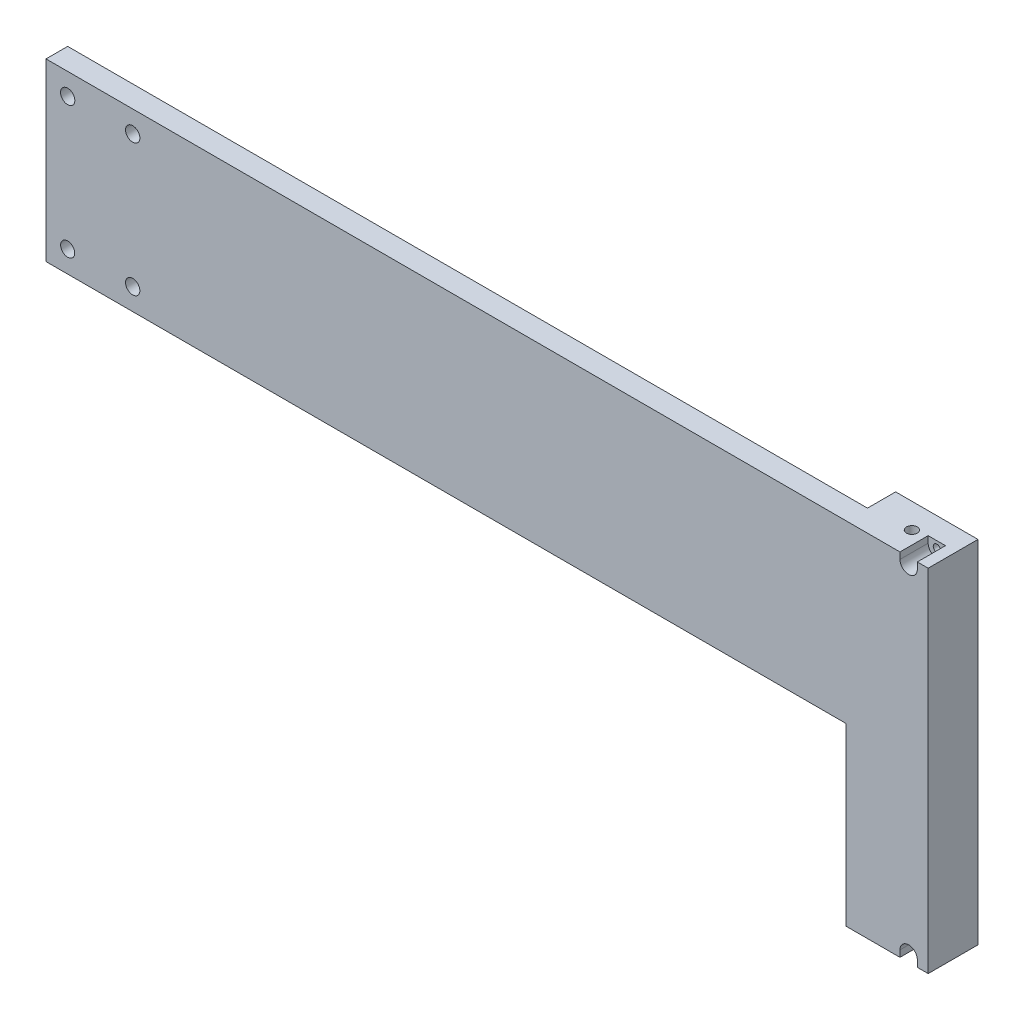
ISO-10303-21;
HEADER;
FILE_DESCRIPTION(('STEP AP214'),'2;1');
FILE_NAME('part.step','',(''),(''),'','','');
FILE_SCHEMA(('AUTOMOTIVE_DESIGN { 1 0 10303 214 1 1 1 1 }'));
ENDSEC;
DATA;
#1=APPLICATION_CONTEXT('core data for automotive mechanical design processes');
#2=APPLICATION_PROTOCOL_DEFINITION('international standard','automotive_design',2000,#1);
#3=PRODUCT_CONTEXT('',#1,'mechanical');
#4=PRODUCT('Part','Part','',(#3));
#5=PRODUCT_RELATED_PRODUCT_CATEGORY('part','',(#4));
#6=PRODUCT_DEFINITION_FORMATION('','',#4);
#7=PRODUCT_DEFINITION_CONTEXT('part definition',#1,'design');
#8=PRODUCT_DEFINITION('design','',#6,#7);
#9=PRODUCT_DEFINITION_SHAPE('','',#8);
#10=(LENGTH_UNIT() NAMED_UNIT(*) SI_UNIT(.MILLI.,.METRE.));
#11=(NAMED_UNIT(*) PLANE_ANGLE_UNIT() SI_UNIT($,.RADIAN.));
#12=(NAMED_UNIT(*) SI_UNIT($,.STERADIAN.) SOLID_ANGLE_UNIT());
#13=UNCERTAINTY_MEASURE_WITH_UNIT(LENGTH_MEASURE(1.E-05),#10,'distance_accuracy_value','');
#14=(GEOMETRIC_REPRESENTATION_CONTEXT(3) GLOBAL_UNCERTAINTY_ASSIGNED_CONTEXT((#13)) GLOBAL_UNIT_ASSIGNED_CONTEXT((#10,
#11,#12)) REPRESENTATION_CONTEXT('',''));
#15=CARTESIAN_POINT('',(0.,0.,0.));
#16=DIRECTION('',(0.,0.,1.));
#17=DIRECTION('',(1.,0.,0.));
#18=AXIS2_PLACEMENT_3D('',#15,#16,#17);
#19=CARTESIAN_POINT('',(398.,78.,-13.));
#20=DIRECTION('',(0.,0.,1.));
#21=DIRECTION('',(1.,0.,0.));
#22=AXIS2_PLACEMENT_3D('',#19,#20,#21);
#23=CYLINDRICAL_SURFACE('',#22,1.64999999999999);
#24=CARTESIAN_POINT('',(398.,78.,-13.));
#25=DIRECTION('',(0.,0.,1.));
#26=DIRECTION('',(1.,0.,0.));
#27=AXIS2_PLACEMENT_3D('',#24,#25,#26);
#28=CIRCLE('',#27,1.64999999999999);
#29=CARTESIAN_POINT('',(399.65,78.,-13.));
#30=VERTEX_POINT('',#29);
#31=EDGE_CURVE('E218',#30,#30,#28,.T.);
#32=ORIENTED_EDGE('',*,*,#31,.F.);
#33=EDGE_LOOP('',(#32));
#34=FACE_BOUND('',#33,.T.);
#35=CARTESIAN_POINT('',(398.,78.,-3.));
#36=DIRECTION('',(0.,0.,1.));
#37=DIRECTION('',(1.,0.,0.));
#38=AXIS2_PLACEMENT_3D('',#35,#36,#37);
#39=CIRCLE('',#38,1.64999999999999);
#40=CARTESIAN_POINT('',(399.65,78.,-3.));
#41=VERTEX_POINT('',#40);
#42=EDGE_CURVE('E221',#41,#41,#39,.F.);
#43=ORIENTED_EDGE('',*,*,#42,.F.);
#44=EDGE_LOOP('',(#43));
#45=FACE_BOUND('',#44,.T.);
#46=ADVANCED_FACE('F40',(#34,#45),#23,.F.);
#47=CARTESIAN_POINT('',(398.,-78.,-13.));
#48=DIRECTION('',(0.,0.,1.));
#49=DIRECTION('',(1.,0.,0.));
#50=AXIS2_PLACEMENT_3D('',#47,#48,#49);
#51=CYLINDRICAL_SURFACE('',#50,1.64999999999999);
#52=CARTESIAN_POINT('',(398.,-78.,-13.));
#53=DIRECTION('',(0.,0.,1.));
#54=DIRECTION('',(1.,0.,0.));
#55=AXIS2_PLACEMENT_3D('',#52,#53,#54);
#56=CIRCLE('',#55,1.64999999999999);
#57=CARTESIAN_POINT('',(399.65,-78.,-13.));
#58=VERTEX_POINT('',#57);
#59=EDGE_CURVE('E214',#58,#58,#56,.T.);
#60=ORIENTED_EDGE('',*,*,#59,.F.);
#61=EDGE_LOOP('',(#60));
#62=FACE_BOUND('',#61,.T.);
#63=CARTESIAN_POINT('',(398.,-78.,-3.));
#64=DIRECTION('',(0.,0.,1.));
#65=DIRECTION('',(1.,0.,0.));
#66=AXIS2_PLACEMENT_3D('',#63,#64,#65);
#67=CIRCLE('',#66,1.64999999999999);
#68=CARTESIAN_POINT('',(399.65,-78.,-3.));
#69=VERTEX_POINT('',#68);
#70=EDGE_CURVE('E186',#69,#69,#67,.F.);
#71=ORIENTED_EDGE('',*,*,#70,.F.);
#72=EDGE_LOOP('',(#71));
#73=FACE_BOUND('',#72,.T.);
#74=ADVANCED_FACE('F375',(#62,#73),#51,.F.);
#75=CARTESIAN_POINT('',(0.,0.,10.));
#76=DIRECTION('',(1.,0.,0.));
#77=DIRECTION('',(0.,0.,-1.));
#78=AXIS2_PLACEMENT_3D('',#75,#76,#77);
#79=PLANE('',#78);
#80=DIRECTION('',(0.,-1.,0.));
#81=VECTOR('',#80,1.);
#82=CARTESIAN_POINT('',(0.,0.,0.));
#83=LINE('',#82,#81);
#84=CARTESIAN_POINT('',(0.,81.,0.));
#85=VERTEX_POINT('',#84);
#86=CARTESIAN_POINT('',(0.,0.,0.));
#87=VERTEX_POINT('',#86);
#88=EDGE_CURVE('E257',#85,#87,#83,.T.);
#89=ORIENTED_EDGE('',*,*,#88,.T.);
#90=DIRECTION('',(0.,0.,-1.));
#91=VECTOR('',#90,1.);
#92=CARTESIAN_POINT('',(0.,0.,10.));
#93=LINE('',#92,#91);
#94=CARTESIAN_POINT('',(0.,0.,10.));
#95=VERTEX_POINT('',#94);
#96=EDGE_CURVE('E11',#95,#87,#93,.T.);
#97=ORIENTED_EDGE('',*,*,#96,.F.);
#98=DIRECTION('',(0.,-1.,0.));
#99=VECTOR('',#98,1.);
#100=CARTESIAN_POINT('',(0.,0.,10.));
#101=LINE('',#100,#99);
#102=CARTESIAN_POINT('',(0.,81.,10.));
#103=VERTEX_POINT('',#102);
#104=EDGE_CURVE('E258',#103,#95,#101,.T.);
#105=ORIENTED_EDGE('',*,*,#104,.F.);
#106=DIRECTION('',(0.,0.,-1.));
#107=VECTOR('',#106,1.);
#108=CARTESIAN_POINT('',(0.,81.,10.));
#109=LINE('',#108,#107);
#110=EDGE_CURVE('E268',#103,#85,#109,.T.);
#111=ORIENTED_EDGE('',*,*,#110,.T.);
#112=EDGE_LOOP('',(#89,#97,#105,#111));
#113=FACE_BOUND('',#112,.T.);
#114=ADVANCED_FACE('F42',(#113),#79,.F.);
#115=CARTESIAN_POINT('',(0.,0.,10.));
#116=DIRECTION('',(0.,1.,0.));
#117=DIRECTION('',(0.,0.,1.));
#118=AXIS2_PLACEMENT_3D('',#115,#116,#117);
#119=PLANE('',#118);
#120=DIRECTION('',(1.,0.,0.));
#121=VECTOR('',#120,1.);
#122=CARTESIAN_POINT('',(0.,0.,0.));
#123=LINE('',#122,#121);
#124=CARTESIAN_POINT('',(369.,0.,0.));
#125=VERTEX_POINT('',#124);
#126=EDGE_CURVE('E271',#87,#125,#123,.T.);
#127=ORIENTED_EDGE('',*,*,#126,.T.);
#128=DIRECTION('',(0.,0.,-1.));
#129=VECTOR('',#128,1.);
#130=CARTESIAN_POINT('',(369.,0.,10.));
#131=LINE('',#130,#129);
#132=CARTESIAN_POINT('',(369.,0.,10.));
#133=VERTEX_POINT('',#132);
#134=EDGE_CURVE('E49',#133,#125,#131,.T.);
#135=ORIENTED_EDGE('',*,*,#134,.F.);
#136=DIRECTION('',(1.,0.,0.));
#137=VECTOR('',#136,1.);
#138=CARTESIAN_POINT('',(0.,0.,10.));
#139=LINE('',#138,#137);
#140=EDGE_CURVE('E261',#95,#133,#139,.T.);
#141=ORIENTED_EDGE('',*,*,#140,.F.);
#142=ORIENTED_EDGE('',*,*,#96,.T.);
#143=EDGE_LOOP('',(#127,#135,#141,#142));
#144=FACE_BOUND('',#143,.T.);
#145=ADVANCED_FACE('F331',(#144),#119,.F.);
#146=CARTESIAN_POINT('',(0.,81.,10.));
#147=DIRECTION('',(0.,-1.,0.));
#148=DIRECTION('',(0.,0.,-1.));
#149=AXIS2_PLACEMENT_3D('',#146,#147,#148);
#150=PLANE('',#149);
#151=DIRECTION('',(-1.,0.,0.));
#152=VECTOR('',#151,1.);
#153=CARTESIAN_POINT('',(0.,81.,10.));
#154=LINE('',#153,#152);
#155=CARTESIAN_POINT('',(394.,81.,10.));
#156=VERTEX_POINT('',#155);
#157=EDGE_CURVE('E264',#156,#103,#154,.T.);
#158=ORIENTED_EDGE('',*,*,#157,.F.);
#159=DIRECTION('',(0.,0.,1.));
#160=VECTOR('',#159,1.);
#161=CARTESIAN_POINT('',(394.,81.,-3.));
#162=LINE('',#161,#160);
#163=CARTESIAN_POINT('',(394.,81.,-3.));
#164=VERTEX_POINT('',#163);
#165=EDGE_CURVE('E187',#164,#156,#162,.T.);
#166=ORIENTED_EDGE('',*,*,#165,.F.);
#167=DIRECTION('',(-1.,0.,0.));
#168=VECTOR('',#167,1.);
#169=CARTESIAN_POINT('',(394.,81.,-3.));
#170=LINE('',#169,#168);
#171=CARTESIAN_POINT('',(402.,81.,-3.));
#172=VERTEX_POINT('',#171);
#173=EDGE_CURVE('E165',#172,#164,#170,.T.);
#174=ORIENTED_EDGE('',*,*,#173,.F.);
#175=DIRECTION('',(0.,0.,1.));
#176=VECTOR('',#175,1.);
#177=CARTESIAN_POINT('',(402.,81.,-3.));
#178=LINE('',#177,#176);
#179=CARTESIAN_POINT('',(402.,81.,10.));
#180=VERTEX_POINT('',#179);
#181=EDGE_CURVE('E156',#172,#180,#178,.T.);
#182=ORIENTED_EDGE('',*,*,#181,.T.);
#183=CARTESIAN_POINT('',(407.,81.,10.));
#184=VERTEX_POINT('',#183);
#185=EDGE_CURVE('E265',#184,#180,#154,.T.);
#186=ORIENTED_EDGE('',*,*,#185,.F.);
#187=DIRECTION('',(0.,0.,1.));
#188=VECTOR('',#187,1.);
#189=CARTESIAN_POINT('',(407.,81.,10.));
#190=LINE('',#189,#188);
#191=CARTESIAN_POINT('',(407.,81.,-13.));
#192=VERTEX_POINT('',#191);
#193=EDGE_CURVE('E236',#192,#184,#190,.T.);
#194=ORIENTED_EDGE('',*,*,#193,.F.);
#195=DIRECTION('',(-1.,0.,0.));
#196=VECTOR('',#195,1.);
#197=CARTESIAN_POINT('',(407.,81.,-13.));
#198=LINE('',#197,#196);
#199=CARTESIAN_POINT('',(369.,81.,-13.));
#200=VERTEX_POINT('',#199);
#201=EDGE_CURVE('E239',#192,#200,#198,.T.);
#202=ORIENTED_EDGE('',*,*,#201,.T.);
#203=DIRECTION('',(0.,0.,1.));
#204=VECTOR('',#203,1.);
#205=CARTESIAN_POINT('',(369.,81.,10.));
#206=LINE('',#205,#204);
#207=CARTESIAN_POINT('',(369.,81.,0.));
#208=VERTEX_POINT('',#207);
#209=EDGE_CURVE('E232',#200,#208,#206,.T.);
#210=ORIENTED_EDGE('',*,*,#209,.T.);
#211=DIRECTION('',(-1.,0.,0.));
#212=VECTOR('',#211,1.);
#213=CARTESIAN_POINT('',(0.,81.,0.));
#214=LINE('',#213,#212);
#215=EDGE_CURVE('E262',#208,#85,#214,.T.);
#216=ORIENTED_EDGE('',*,*,#215,.T.);
#217=ORIENTED_EDGE('',*,*,#110,.F.);
#218=EDGE_LOOP('',(#158,#166,#174,#182,#186,#194,#202,#210,#216,#217));
#219=FACE_BOUND('',#218,.T.);
#220=CARTESIAN_POINT('',(388.,81.,-1.5));
#221=DIRECTION('',(0.,1.,0.));
#222=DIRECTION('',(0.,0.,1.));
#223=AXIS2_PLACEMENT_3D('',#220,#221,#222);
#224=CIRCLE('',#223,2.50000000000002);
#225=CARTESIAN_POINT('',(388.,81.,1.00000000000002));
#226=VERTEX_POINT('',#225);
#227=EDGE_CURVE('E217',#226,#226,#224,.T.);
#228=ORIENTED_EDGE('',*,*,#227,.F.);
#229=EDGE_LOOP('',(#228));
#230=FACE_BOUND('',#229,.T.);
#231=ADVANCED_FACE('F319',(#219,#230),#150,.F.);
#232=CARTESIAN_POINT('',(0.,0.,10.));
#233=DIRECTION('',(0.,0.,-1.));
#234=DIRECTION('',(-1.,0.,0.));
#235=AXIS2_PLACEMENT_3D('',#232,#233,#234);
#236=PLANE('',#235);
#237=CARTESIAN_POINT('',(10.,10.,10.));
#238=DIRECTION('',(0.,0.,1.));
#239=DIRECTION('',(1.,0.,0.));
#240=AXIS2_PLACEMENT_3D('',#237,#238,#239);
#241=CIRCLE('',#240,3.25);
#242=CARTESIAN_POINT('',(13.25,10.,10.));
#243=VERTEX_POINT('',#242);
#244=EDGE_CURVE('E545',#243,#243,#241,.T.);
#245=ORIENTED_EDGE('',*,*,#244,.F.);
#246=EDGE_LOOP('',(#245));
#247=FACE_BOUND('',#246,.T.);
#248=CARTESIAN_POINT('',(40.,10.,10.));
#249=DIRECTION('',(0.,0.,1.));
#250=DIRECTION('',(1.,0.,0.));
#251=AXIS2_PLACEMENT_3D('',#248,#249,#250);
#252=CIRCLE('',#251,3.3);
#253=CARTESIAN_POINT('',(43.3,10.,10.));
#254=VERTEX_POINT('',#253);
#255=EDGE_CURVE('E542',#254,#254,#252,.T.);
#256=ORIENTED_EDGE('',*,*,#255,.F.);
#257=EDGE_LOOP('',(#256));
#258=FACE_BOUND('',#257,.T.);
#259=CARTESIAN_POINT('',(40.,71.,10.));
#260=DIRECTION('',(0.,0.,1.));
#261=DIRECTION('',(1.,0.,0.));
#262=AXIS2_PLACEMENT_3D('',#259,#260,#261);
#263=CIRCLE('',#262,3.3);
#264=CARTESIAN_POINT('',(43.3,71.,10.));
#265=VERTEX_POINT('',#264);
#266=EDGE_CURVE('E544',#265,#265,#263,.T.);
#267=ORIENTED_EDGE('',*,*,#266,.F.);
#268=EDGE_LOOP('',(#267));
#269=FACE_BOUND('',#268,.T.);
#270=CARTESIAN_POINT('',(10.,71.,10.));
#271=DIRECTION('',(0.,0.,1.));
#272=DIRECTION('',(1.,0.,0.));
#273=AXIS2_PLACEMENT_3D('',#270,#271,#272);
#274=CIRCLE('',#273,3.3);
#275=CARTESIAN_POINT('',(13.3,71.,10.));
#276=VERTEX_POINT('',#275);
#277=EDGE_CURVE('E176',#276,#276,#274,.T.);
#278=ORIENTED_EDGE('',*,*,#277,.F.);
#279=EDGE_LOOP('',(#278));
#280=FACE_BOUND('',#279,.T.);
#281=CARTESIAN_POINT('',(398.,78.,10.));
#282=DIRECTION('',(0.,0.,1.));
#283=DIRECTION('',(1.,0.,0.));
#284=AXIS2_PLACEMENT_3D('',#281,#282,#283);
#285=CIRCLE('',#284,4.);
#286=CARTESIAN_POINT('',(394.,78.,10.));
#287=VERTEX_POINT('',#286);
#288=CARTESIAN_POINT('',(402.,78.,10.));
#289=VERTEX_POINT('',#288);
#290=EDGE_CURVE('E57',#287,#289,#285,.T.);
#291=ORIENTED_EDGE('',*,*,#290,.F.);
#292=DIRECTION('',(0.,-1.,0.));
#293=VECTOR('',#292,1.);
#294=CARTESIAN_POINT('',(394.,78.,10.));
#295=LINE('',#294,#293);
#296=EDGE_CURVE('E170',#156,#287,#295,.T.);
#297=ORIENTED_EDGE('',*,*,#296,.F.);
#298=ORIENTED_EDGE('',*,*,#157,.T.);
#299=ORIENTED_EDGE('',*,*,#104,.T.);
#300=ORIENTED_EDGE('',*,*,#140,.T.);
#301=DIRECTION('',(0.,-1.,0.));
#302=VECTOR('',#301,1.);
#303=CARTESIAN_POINT('',(369.,81.,10.));
#304=LINE('',#303,#302);
#305=CARTESIAN_POINT('',(369.,-81.,9.99999999999998));
#306=VERTEX_POINT('',#305);
#307=EDGE_CURVE('E225',#133,#306,#304,.T.);
#308=ORIENTED_EDGE('',*,*,#307,.T.);
#309=DIRECTION('',(-1.,0.,0.));
#310=VECTOR('',#309,1.);
#311=CARTESIAN_POINT('',(407.,-81.,9.99999999999998));
#312=LINE('',#311,#310);
#313=CARTESIAN_POINT('',(394.,-81.,10.));
#314=VERTEX_POINT('',#313);
#315=EDGE_CURVE('E253',#314,#306,#312,.T.);
#316=ORIENTED_EDGE('',*,*,#315,.F.);
#317=DIRECTION('',(0.,-1.,0.));
#318=VECTOR('',#317,1.);
#319=CARTESIAN_POINT('',(394.,-78.,10.));
#320=LINE('',#319,#318);
#321=CARTESIAN_POINT('',(394.,-78.,10.));
#322=VERTEX_POINT('',#321);
#323=EDGE_CURVE('E203',#322,#314,#320,.T.);
#324=ORIENTED_EDGE('',*,*,#323,.F.);
#325=CARTESIAN_POINT('',(398.,-78.,10.));
#326=DIRECTION('',(0.,0.,1.));
#327=DIRECTION('',(1.,0.,0.));
#328=AXIS2_PLACEMENT_3D('',#325,#326,#327);
#329=CIRCLE('',#328,4.);
#330=CARTESIAN_POINT('',(402.,-78.,10.));
#331=VERTEX_POINT('',#330);
#332=EDGE_CURVE('E200',#331,#322,#329,.T.);
#333=ORIENTED_EDGE('',*,*,#332,.F.);
#334=DIRECTION('',(0.,1.,0.));
#335=VECTOR('',#334,1.);
#336=CARTESIAN_POINT('',(402.,-78.,10.));
#337=LINE('',#336,#335);
#338=CARTESIAN_POINT('',(402.,-81.,10.));
#339=VERTEX_POINT('',#338);
#340=EDGE_CURVE('E192',#339,#331,#337,.T.);
#341=ORIENTED_EDGE('',*,*,#340,.F.);
#342=CARTESIAN_POINT('',(407.,-81.,9.99999999999998));
#343=VERTEX_POINT('',#342);
#344=EDGE_CURVE('E254',#343,#339,#312,.T.);
#345=ORIENTED_EDGE('',*,*,#344,.F.);
#346=DIRECTION('',(0.,-1.,0.));
#347=VECTOR('',#346,1.);
#348=CARTESIAN_POINT('',(407.,81.,10.));
#349=LINE('',#348,#347);
#350=EDGE_CURVE('E228',#184,#343,#349,.T.);
#351=ORIENTED_EDGE('',*,*,#350,.F.);
#352=ORIENTED_EDGE('',*,*,#185,.T.);
#353=DIRECTION('',(0.,1.,0.));
#354=VECTOR('',#353,1.);
#355=CARTESIAN_POINT('',(402.,78.,10.));
#356=LINE('',#355,#354);
#357=EDGE_CURVE('E173',#289,#180,#356,.T.);
#358=ORIENTED_EDGE('',*,*,#357,.F.);
#359=EDGE_LOOP('',(#291,#297,#298,#299,#300,#308,#316,#324,#333,#341,#345,#351,#352,#358));
#360=FACE_BOUND('',#359,.T.);
#361=ADVANCED_FACE('F305',(#247,#258,#269,#280,#360),#236,.F.);
#362=CARTESIAN_POINT('',(0.,0.,0.));
#363=DIRECTION('',(0.,0.,-1.));
#364=DIRECTION('',(-1.,0.,0.));
#365=AXIS2_PLACEMENT_3D('',#362,#363,#364);
#366=PLANE('',#365);
#367=CARTESIAN_POINT('',(10.,10.,0.));
#368=DIRECTION('',(0.,0.,-1.));
#369=DIRECTION('',(-1.,0.,0.));
#370=AXIS2_PLACEMENT_3D('',#367,#368,#369);
#371=CIRCLE('',#370,3.25);
#372=CARTESIAN_POINT('',(6.75000000000001,10.,0.));
#373=VERTEX_POINT('',#372);
#374=EDGE_CURVE('E44',#373,#373,#371,.T.);
#375=ORIENTED_EDGE('',*,*,#374,.F.);
#376=EDGE_LOOP('',(#375));
#377=FACE_BOUND('',#376,.T.);
#378=CARTESIAN_POINT('',(40.,10.,0.));
#379=DIRECTION('',(0.,0.,-1.));
#380=DIRECTION('',(-1.,0.,0.));
#381=AXIS2_PLACEMENT_3D('',#378,#379,#380);
#382=CIRCLE('',#381,3.3);
#383=CARTESIAN_POINT('',(36.7,10.,0.));
#384=VERTEX_POINT('',#383);
#385=EDGE_CURVE('E291',#384,#384,#382,.T.);
#386=ORIENTED_EDGE('',*,*,#385,.F.);
#387=EDGE_LOOP('',(#386));
#388=FACE_BOUND('',#387,.T.);
#389=CARTESIAN_POINT('',(40.,71.,0.));
#390=DIRECTION('',(0.,0.,-1.));
#391=DIRECTION('',(-1.,0.,0.));
#392=AXIS2_PLACEMENT_3D('',#389,#390,#391);
#393=CIRCLE('',#392,3.3);
#394=CARTESIAN_POINT('',(36.7,71.,0.));
#395=VERTEX_POINT('',#394);
#396=EDGE_CURVE('E289',#395,#395,#393,.T.);
#397=ORIENTED_EDGE('',*,*,#396,.F.);
#398=EDGE_LOOP('',(#397));
#399=FACE_BOUND('',#398,.T.);
#400=CARTESIAN_POINT('',(10.,71.,0.));
#401=DIRECTION('',(0.,0.,-1.));
#402=DIRECTION('',(-1.,0.,0.));
#403=AXIS2_PLACEMENT_3D('',#400,#401,#402);
#404=CIRCLE('',#403,3.3);
#405=CARTESIAN_POINT('',(6.70000000000001,71.,0.));
#406=VERTEX_POINT('',#405);
#407=EDGE_CURVE('E286',#406,#406,#404,.T.);
#408=ORIENTED_EDGE('',*,*,#407,.F.);
#409=EDGE_LOOP('',(#408));
#410=FACE_BOUND('',#409,.T.);
#411=ORIENTED_EDGE('',*,*,#88,.F.);
#412=ORIENTED_EDGE('',*,*,#215,.F.);
#413=DIRECTION('',(0.,1.,0.));
#414=VECTOR('',#413,1.);
#415=CARTESIAN_POINT('',(369.,0.,0.));
#416=LINE('',#415,#414);
#417=EDGE_CURVE('E274',#125,#208,#416,.T.);
#418=ORIENTED_EDGE('',*,*,#417,.F.);
#419=ORIENTED_EDGE('',*,*,#126,.F.);
#420=EDGE_LOOP('',(#411,#412,#418,#419));
#421=FACE_BOUND('',#420,.T.);
#422=ADVANCED_FACE('F301',(#377,#388,#399,#410,#421),#366,.T.);
#423=CARTESIAN_POINT('',(369.,0.,0.));
#424=DIRECTION('',(1.,0.,0.));
#425=DIRECTION('',(0.,0.,-1.));
#426=AXIS2_PLACEMENT_3D('',#423,#424,#425);
#427=PLANE('',#426);
#428=ORIENTED_EDGE('',*,*,#134,.T.);
#429=ORIENTED_EDGE('',*,*,#417,.T.);
#430=ORIENTED_EDGE('',*,*,#209,.F.);
#431=DIRECTION('',(0.,1.,0.));
#432=VECTOR('',#431,1.);
#433=CARTESIAN_POINT('',(369.,81.,-13.));
#434=LINE('',#433,#432);
#435=CARTESIAN_POINT('',(369.,-81.,-13.));
#436=VERTEX_POINT('',#435);
#437=EDGE_CURVE('E244',#436,#200,#434,.T.);
#438=ORIENTED_EDGE('',*,*,#437,.F.);
#439=DIRECTION('',(0.,0.,-1.));
#440=VECTOR('',#439,1.);
#441=CARTESIAN_POINT('',(369.,-81.,9.99999999999998));
#442=LINE('',#441,#440);
#443=EDGE_CURVE('E242',#306,#436,#442,.T.);
#444=ORIENTED_EDGE('',*,*,#443,.F.);
#445=ORIENTED_EDGE('',*,*,#307,.F.);
#446=EDGE_LOOP('',(#428,#429,#430,#438,#444,#445));
#447=FACE_BOUND('',#446,.T.);
#448=ADVANCED_FACE('F304',(#447),#427,.F.);
#449=CARTESIAN_POINT('',(407.,-81.,9.99999999999998));
#450=DIRECTION('',(0.,1.,0.));
#451=DIRECTION('',(0.,0.,1.));
#452=AXIS2_PLACEMENT_3D('',#449,#450,#451);
#453=PLANE('',#452);
#454=ORIENTED_EDGE('',*,*,#344,.T.);
#455=DIRECTION('',(0.,0.,1.));
#456=VECTOR('',#455,1.);
#457=CARTESIAN_POINT('',(402.,-81.,-3.));
#458=LINE('',#457,#456);
#459=CARTESIAN_POINT('',(402.,-81.,-3.));
#460=VERTEX_POINT('',#459);
#461=EDGE_CURVE('E208',#460,#339,#458,.T.);
#462=ORIENTED_EDGE('',*,*,#461,.F.);
#463=DIRECTION('',(1.,0.,0.));
#464=VECTOR('',#463,1.);
#465=CARTESIAN_POINT('',(394.,-81.,-3.));
#466=LINE('',#465,#464);
#467=CARTESIAN_POINT('',(394.,-81.,-3.));
#468=VERTEX_POINT('',#467);
#469=EDGE_CURVE('E194',#468,#460,#466,.T.);
#470=ORIENTED_EDGE('',*,*,#469,.F.);
#471=DIRECTION('',(0.,0.,1.));
#472=VECTOR('',#471,1.);
#473=CARTESIAN_POINT('',(394.,-81.,-3.));
#474=LINE('',#473,#472);
#475=EDGE_CURVE('E210',#468,#314,#474,.T.);
#476=ORIENTED_EDGE('',*,*,#475,.T.);
#477=ORIENTED_EDGE('',*,*,#315,.T.);
#478=ORIENTED_EDGE('',*,*,#443,.T.);
#479=DIRECTION('',(-1.,0.,0.));
#480=VECTOR('',#479,1.);
#481=CARTESIAN_POINT('',(407.,-81.,-13.));
#482=LINE('',#481,#480);
#483=CARTESIAN_POINT('',(407.,-81.,-13.));
#484=VERTEX_POINT('',#483);
#485=EDGE_CURVE('E250',#484,#436,#482,.T.);
#486=ORIENTED_EDGE('',*,*,#485,.F.);
#487=DIRECTION('',(0.,0.,-1.));
#488=VECTOR('',#487,1.);
#489=CARTESIAN_POINT('',(407.,-81.,9.99999999999998));
#490=LINE('',#489,#488);
#491=EDGE_CURVE('E231',#343,#484,#490,.T.);
#492=ORIENTED_EDGE('',*,*,#491,.F.);
#493=EDGE_LOOP('',(#454,#462,#470,#476,#477,#478,#486,#492));
#494=FACE_BOUND('',#493,.T.);
#495=CARTESIAN_POINT('',(388.,-81.,-1.5));
#496=DIRECTION('',(0.,1.,0.));
#497=DIRECTION('',(0.,0.,1.));
#498=AXIS2_PLACEMENT_3D('',#495,#496,#497);
#499=CIRCLE('',#498,2.50000000000002);
#500=CARTESIAN_POINT('',(388.,-81.,1.00000000000002));
#501=VERTEX_POINT('',#500);
#502=EDGE_CURVE('E222',#501,#501,#499,.T.);
#503=ORIENTED_EDGE('',*,*,#502,.T.);
#504=EDGE_LOOP('',(#503));
#505=FACE_BOUND('',#504,.T.);
#506=ADVANCED_FACE('F346',(#494,#505),#453,.F.);
#507=CARTESIAN_POINT('',(407.,81.,-13.));
#508=DIRECTION('',(0.,0.,1.));
#509=DIRECTION('',(0.,-1.,0.));
#510=AXIS2_PLACEMENT_3D('',#507,#508,#509);
#511=PLANE('',#510);
#512=ORIENTED_EDGE('',*,*,#59,.T.);
#513=EDGE_LOOP('',(#512));
#514=FACE_BOUND('',#513,.T.);
#515=ORIENTED_EDGE('',*,*,#31,.T.);
#516=EDGE_LOOP('',(#515));
#517=FACE_BOUND('',#516,.T.);
#518=ORIENTED_EDGE('',*,*,#437,.T.);
#519=ORIENTED_EDGE('',*,*,#201,.F.);
#520=DIRECTION('',(0.,1.,0.));
#521=VECTOR('',#520,1.);
#522=CARTESIAN_POINT('',(407.,81.,-13.));
#523=LINE('',#522,#521);
#524=EDGE_CURVE('E234',#484,#192,#523,.T.);
#525=ORIENTED_EDGE('',*,*,#524,.F.);
#526=ORIENTED_EDGE('',*,*,#485,.T.);
#527=EDGE_LOOP('',(#518,#519,#525,#526));
#528=FACE_BOUND('',#527,.T.);
#529=ADVANCED_FACE('F344',(#514,#517,#528),#511,.F.);
#530=CARTESIAN_POINT('',(407.,0.,0.));
#531=DIRECTION('',(1.,0.,0.));
#532=DIRECTION('',(0.,0.,-1.));
#533=AXIS2_PLACEMENT_3D('',#530,#531,#532);
#534=PLANE('',#533);
#535=ORIENTED_EDGE('',*,*,#350,.T.);
#536=ORIENTED_EDGE('',*,*,#491,.T.);
#537=ORIENTED_EDGE('',*,*,#524,.T.);
#538=ORIENTED_EDGE('',*,*,#193,.T.);
#539=EDGE_LOOP('',(#535,#536,#537,#538));
#540=FACE_BOUND('',#539,.T.);
#541=ADVANCED_FACE('F340',(#540),#534,.T.);
#542=CARTESIAN_POINT('',(388.,-81.,-1.5));
#543=DIRECTION('',(0.,1.,0.));
#544=DIRECTION('',(0.,0.,1.));
#545=AXIS2_PLACEMENT_3D('',#542,#543,#544);
#546=CYLINDRICAL_SURFACE('',#545,2.50000000000002);
#547=ORIENTED_EDGE('',*,*,#502,.F.);
#548=EDGE_LOOP('',(#547));
#549=FACE_BOUND('',#548,.T.);
#550=ORIENTED_EDGE('',*,*,#227,.T.);
#551=EDGE_LOOP('',(#550));
#552=FACE_BOUND('',#551,.T.);
#553=ADVANCED_FACE('F370',(#549,#552),#546,.F.);
#554=CARTESIAN_POINT('',(398.,-78.,-3.));
#555=DIRECTION('',(0.,0.,1.));
#556=DIRECTION('',(1.,0.,0.));
#557=AXIS2_PLACEMENT_3D('',#554,#555,#556);
#558=PLANE('',#557);
#559=CARTESIAN_POINT('',(398.,-78.,-3.));
#560=DIRECTION('',(0.,0.,1.));
#561=DIRECTION('',(1.,0.,0.));
#562=AXIS2_PLACEMENT_3D('',#559,#560,#561);
#563=CIRCLE('',#562,4.);
#564=CARTESIAN_POINT('',(402.,-78.,-3.));
#565=VERTEX_POINT('',#564);
#566=CARTESIAN_POINT('',(394.,-78.,-3.));
#567=VERTEX_POINT('',#566);
#568=EDGE_CURVE('E190',#565,#567,#563,.T.);
#569=ORIENTED_EDGE('',*,*,#568,.T.);
#570=DIRECTION('',(0.,-1.,0.));
#571=VECTOR('',#570,1.);
#572=CARTESIAN_POINT('',(394.,-78.,-3.));
#573=LINE('',#572,#571);
#574=EDGE_CURVE('E65',#567,#468,#573,.T.);
#575=ORIENTED_EDGE('',*,*,#574,.T.);
#576=ORIENTED_EDGE('',*,*,#469,.T.);
#577=DIRECTION('',(0.,1.,0.));
#578=VECTOR('',#577,1.);
#579=CARTESIAN_POINT('',(402.,-78.,-3.));
#580=LINE('',#579,#578);
#581=EDGE_CURVE('E196',#460,#565,#580,.T.);
#582=ORIENTED_EDGE('',*,*,#581,.T.);
#583=EDGE_LOOP('',(#569,#575,#576,#582));
#584=FACE_BOUND('',#583,.T.);
#585=ORIENTED_EDGE('',*,*,#70,.T.);
#586=EDGE_LOOP('',(#585));
#587=FACE_BOUND('',#586,.T.);
#588=ADVANCED_FACE('F356',(#584,#587),#558,.T.);
#589=CARTESIAN_POINT('',(398.,-78.,-3.));
#590=DIRECTION('',(0.,0.,1.));
#591=DIRECTION('',(1.,0.,0.));
#592=AXIS2_PLACEMENT_3D('',#589,#590,#591);
#593=CYLINDRICAL_SURFACE('',#592,4.);
#594=ORIENTED_EDGE('',*,*,#332,.T.);
#595=DIRECTION('',(0.,0.,1.));
#596=VECTOR('',#595,1.);
#597=CARTESIAN_POINT('',(394.,-78.,-3.));
#598=LINE('',#597,#596);
#599=EDGE_CURVE('E199',#567,#322,#598,.T.);
#600=ORIENTED_EDGE('',*,*,#599,.F.);
#601=ORIENTED_EDGE('',*,*,#568,.F.);
#602=DIRECTION('',(0.,0.,1.));
#603=VECTOR('',#602,1.);
#604=CARTESIAN_POINT('',(402.,-78.,-3.));
#605=LINE('',#604,#603);
#606=EDGE_CURVE('E182',#565,#331,#605,.T.);
#607=ORIENTED_EDGE('',*,*,#606,.T.);
#608=EDGE_LOOP('',(#594,#600,#601,#607));
#609=FACE_BOUND('',#608,.T.);
#610=ADVANCED_FACE('F362',(#609),#593,.F.);
#611=CARTESIAN_POINT('',(402.,-78.,-3.));
#612=DIRECTION('',(1.,0.,0.));
#613=DIRECTION('',(0.,0.,-1.));
#614=AXIS2_PLACEMENT_3D('',#611,#612,#613);
#615=PLANE('',#614);
#616=ORIENTED_EDGE('',*,*,#340,.T.);
#617=ORIENTED_EDGE('',*,*,#606,.F.);
#618=ORIENTED_EDGE('',*,*,#581,.F.);
#619=ORIENTED_EDGE('',*,*,#461,.T.);
#620=EDGE_LOOP('',(#616,#617,#618,#619));
#621=FACE_BOUND('',#620,.T.);
#622=ADVANCED_FACE('F359',(#621),#615,.F.);
#623=CARTESIAN_POINT('',(394.,-78.,-3.));
#624=DIRECTION('',(-1.,0.,0.));
#625=DIRECTION('',(0.,0.,1.));
#626=AXIS2_PLACEMENT_3D('',#623,#624,#625);
#627=PLANE('',#626);
#628=ORIENTED_EDGE('',*,*,#323,.T.);
#629=ORIENTED_EDGE('',*,*,#475,.F.);
#630=ORIENTED_EDGE('',*,*,#574,.F.);
#631=ORIENTED_EDGE('',*,*,#599,.T.);
#632=EDGE_LOOP('',(#628,#629,#630,#631));
#633=FACE_BOUND('',#632,.T.);
#634=ADVANCED_FACE('F352',(#633),#627,.F.);
#635=CARTESIAN_POINT('',(398.,78.,-3.));
#636=DIRECTION('',(0.,0.,1.));
#637=DIRECTION('',(1.,0.,0.));
#638=AXIS2_PLACEMENT_3D('',#635,#636,#637);
#639=PLANE('',#638);
#640=CARTESIAN_POINT('',(398.,78.,-3.));
#641=DIRECTION('',(0.,0.,1.));
#642=DIRECTION('',(1.,0.,0.));
#643=AXIS2_PLACEMENT_3D('',#640,#641,#642);
#644=CIRCLE('',#643,4.);
#645=CARTESIAN_POINT('',(394.,78.,-3.));
#646=VERTEX_POINT('',#645);
#647=CARTESIAN_POINT('',(402.,78.,-3.));
#648=VERTEX_POINT('',#647);
#649=EDGE_CURVE('E152',#646,#648,#644,.T.);
#650=ORIENTED_EDGE('',*,*,#649,.T.);
#651=DIRECTION('',(0.,1.,0.));
#652=VECTOR('',#651,1.);
#653=CARTESIAN_POINT('',(402.,78.,-3.));
#654=LINE('',#653,#652);
#655=EDGE_CURVE('E160',#648,#172,#654,.T.);
#656=ORIENTED_EDGE('',*,*,#655,.T.);
#657=ORIENTED_EDGE('',*,*,#173,.T.);
#658=DIRECTION('',(0.,-1.,0.));
#659=VECTOR('',#658,1.);
#660=CARTESIAN_POINT('',(394.,78.,-3.));
#661=LINE('',#660,#659);
#662=EDGE_CURVE('E157',#164,#646,#661,.T.);
#663=ORIENTED_EDGE('',*,*,#662,.T.);
#664=EDGE_LOOP('',(#650,#656,#657,#663));
#665=FACE_BOUND('',#664,.T.);
#666=ORIENTED_EDGE('',*,*,#42,.T.);
#667=EDGE_LOOP('',(#666));
#668=FACE_BOUND('',#667,.T.);
#669=ADVANCED_FACE('F167',(#665,#668),#639,.T.);
#670=CARTESIAN_POINT('',(398.,78.,-3.));
#671=DIRECTION('',(0.,0.,1.));
#672=DIRECTION('',(1.,0.,0.));
#673=AXIS2_PLACEMENT_3D('',#670,#671,#672);
#674=CYLINDRICAL_SURFACE('',#673,4.);
#675=ORIENTED_EDGE('',*,*,#290,.T.);
#676=DIRECTION('',(0.,0.,1.));
#677=VECTOR('',#676,1.);
#678=CARTESIAN_POINT('',(402.,78.,-3.));
#679=LINE('',#678,#677);
#680=EDGE_CURVE('E148',#648,#289,#679,.T.);
#681=ORIENTED_EDGE('',*,*,#680,.F.);
#682=ORIENTED_EDGE('',*,*,#649,.F.);
#683=DIRECTION('',(0.,0.,1.));
#684=VECTOR('',#683,1.);
#685=CARTESIAN_POINT('',(394.,78.,-3.));
#686=LINE('',#685,#684);
#687=EDGE_CURVE('E184',#646,#287,#686,.T.);
#688=ORIENTED_EDGE('',*,*,#687,.T.);
#689=EDGE_LOOP('',(#675,#681,#682,#688));
#690=FACE_BOUND('',#689,.T.);
#691=ADVANCED_FACE('F150',(#690),#674,.F.);
#692=CARTESIAN_POINT('',(394.,78.,-3.));
#693=DIRECTION('',(-1.,0.,0.));
#694=DIRECTION('',(0.,0.,1.));
#695=AXIS2_PLACEMENT_3D('',#692,#693,#694);
#696=PLANE('',#695);
#697=ORIENTED_EDGE('',*,*,#296,.T.);
#698=ORIENTED_EDGE('',*,*,#687,.F.);
#699=ORIENTED_EDGE('',*,*,#662,.F.);
#700=ORIENTED_EDGE('',*,*,#165,.T.);
#701=EDGE_LOOP('',(#697,#698,#699,#700));
#702=FACE_BOUND('',#701,.T.);
#703=ADVANCED_FACE('F335',(#702),#696,.F.);
#704=CARTESIAN_POINT('',(402.,78.,-3.));
#705=DIRECTION('',(1.,0.,0.));
#706=DIRECTION('',(0.,0.,-1.));
#707=AXIS2_PLACEMENT_3D('',#704,#705,#706);
#708=PLANE('',#707);
#709=ORIENTED_EDGE('',*,*,#357,.T.);
#710=ORIENTED_EDGE('',*,*,#181,.F.);
#711=ORIENTED_EDGE('',*,*,#655,.F.);
#712=ORIENTED_EDGE('',*,*,#680,.T.);
#713=EDGE_LOOP('',(#709,#710,#711,#712));
#714=FACE_BOUND('',#713,.T.);
#715=ADVANCED_FACE('F161',(#714),#708,.F.);
#716=CARTESIAN_POINT('',(10.,71.,-3.));
#717=DIRECTION('',(0.,0.,1.));
#718=DIRECTION('',(1.,0.,0.));
#719=AXIS2_PLACEMENT_3D('',#716,#717,#718);
#720=CYLINDRICAL_SURFACE('',#719,3.3);
#721=ORIENTED_EDGE('',*,*,#407,.T.);
#722=EDGE_LOOP('',(#721));
#723=FACE_BOUND('',#722,.T.);
#724=ORIENTED_EDGE('',*,*,#277,.T.);
#725=EDGE_LOOP('',(#724));
#726=FACE_BOUND('',#725,.T.);
#727=ADVANCED_FACE('F488',(#723,#726),#720,.F.);
#728=CARTESIAN_POINT('',(40.,71.,-3.));
#729=DIRECTION('',(0.,0.,1.));
#730=DIRECTION('',(1.,0.,0.));
#731=AXIS2_PLACEMENT_3D('',#728,#729,#730);
#732=CYLINDRICAL_SURFACE('',#731,3.3);
#733=ORIENTED_EDGE('',*,*,#396,.T.);
#734=EDGE_LOOP('',(#733));
#735=FACE_BOUND('',#734,.T.);
#736=ORIENTED_EDGE('',*,*,#266,.T.);
#737=EDGE_LOOP('',(#736));
#738=FACE_BOUND('',#737,.T.);
#739=ADVANCED_FACE('F508',(#735,#738),#732,.F.);
#740=CARTESIAN_POINT('',(40.,10.,-3.));
#741=DIRECTION('',(0.,0.,1.));
#742=DIRECTION('',(1.,0.,0.));
#743=AXIS2_PLACEMENT_3D('',#740,#741,#742);
#744=CYLINDRICAL_SURFACE('',#743,3.3);
#745=ORIENTED_EDGE('',*,*,#385,.T.);
#746=EDGE_LOOP('',(#745));
#747=FACE_BOUND('',#746,.T.);
#748=ORIENTED_EDGE('',*,*,#255,.T.);
#749=EDGE_LOOP('',(#748));
#750=FACE_BOUND('',#749,.T.);
#751=ADVANCED_FACE('F518',(#747,#750),#744,.F.);
#752=CARTESIAN_POINT('',(10.,10.,-3.));
#753=DIRECTION('',(0.,0.,1.));
#754=DIRECTION('',(1.,0.,0.));
#755=AXIS2_PLACEMENT_3D('',#752,#753,#754);
#756=CYLINDRICAL_SURFACE('',#755,3.25);
#757=ORIENTED_EDGE('',*,*,#374,.T.);
#758=EDGE_LOOP('',(#757));
#759=FACE_BOUND('',#758,.T.);
#760=ORIENTED_EDGE('',*,*,#244,.T.);
#761=EDGE_LOOP('',(#760));
#762=FACE_BOUND('',#761,.T.);
#763=ADVANCED_FACE('F298',(#759,#762),#756,.F.);
#764=CLOSED_SHELL('',(#46,#74,#114,#145,#231,#361,#422,#448,#506,#529,#541,#553,#588,#610,#622,
#634,#669,#691,#703,#715,#727,#739,#751,#763));
#765=MANIFOLD_SOLID_BREP('B2',#764);
#766=ADVANCED_BREP_SHAPE_REPRESENTATION('',(#18,#765),#14);
#767=SHAPE_DEFINITION_REPRESENTATION(#9,#766);
ENDSEC;
END-ISO-10303-21;
